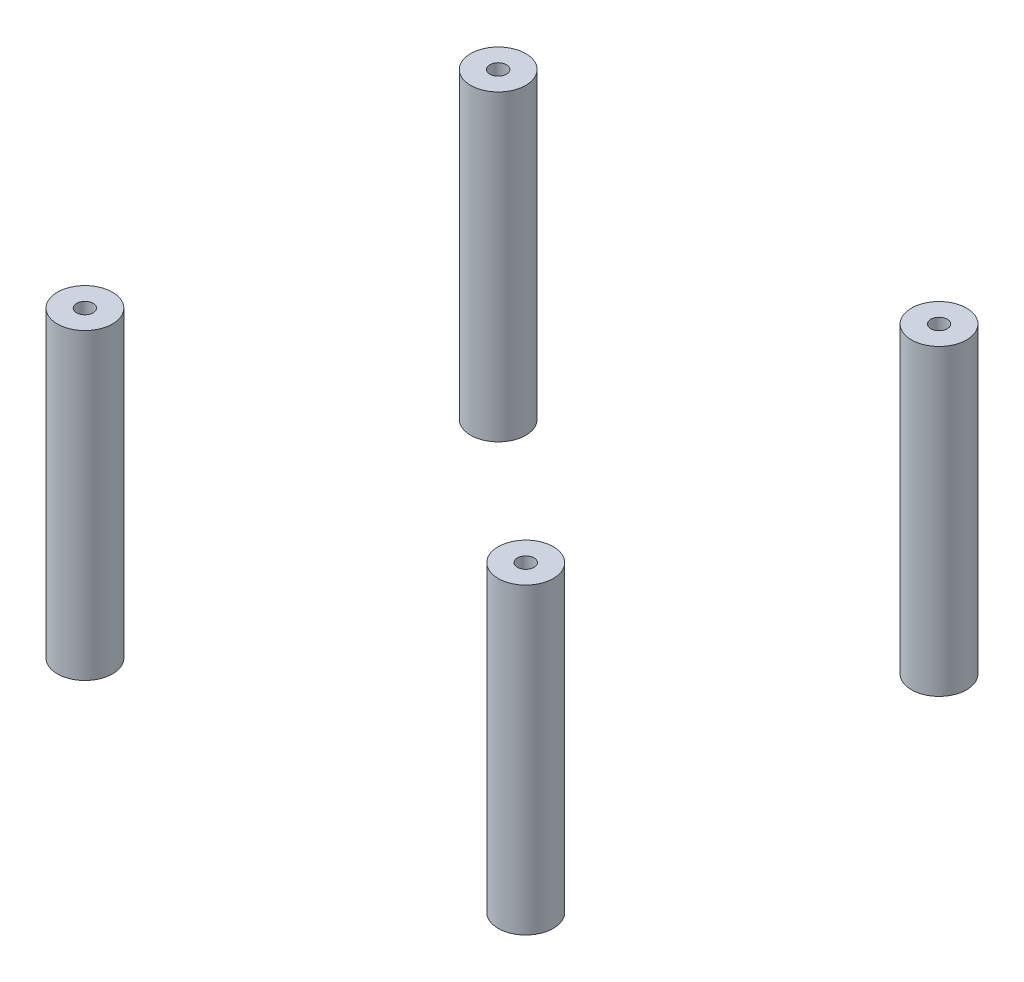
ISO-10303-21;
HEADER;
FILE_DESCRIPTION(('STEP AP214'),'2;1');
FILE_NAME('part.step','',(''),(''),'','','');
FILE_SCHEMA(('AUTOMOTIVE_DESIGN { 1 0 10303 214 1 1 1 1 }'));
ENDSEC;
DATA;
#1=APPLICATION_CONTEXT('core data for automotive mechanical design processes');
#2=APPLICATION_PROTOCOL_DEFINITION('international standard','automotive_design',2000,#1);
#3=PRODUCT_CONTEXT('',#1,'mechanical');
#4=PRODUCT('Part','Part','',(#3));
#5=PRODUCT_RELATED_PRODUCT_CATEGORY('part','',(#4));
#6=PRODUCT_DEFINITION_FORMATION('','',#4);
#7=PRODUCT_DEFINITION_CONTEXT('part definition',#1,'design');
#8=PRODUCT_DEFINITION('design','',#6,#7);
#9=PRODUCT_DEFINITION_SHAPE('','',#8);
#10=(LENGTH_UNIT() NAMED_UNIT(*) SI_UNIT(.MILLI.,.METRE.));
#11=(NAMED_UNIT(*) PLANE_ANGLE_UNIT() SI_UNIT($,.RADIAN.));
#12=(NAMED_UNIT(*) SI_UNIT($,.STERADIAN.) SOLID_ANGLE_UNIT());
#13=UNCERTAINTY_MEASURE_WITH_UNIT(LENGTH_MEASURE(1.E-05),#10,'distance_accuracy_value','');
#14=(GEOMETRIC_REPRESENTATION_CONTEXT(3) GLOBAL_UNCERTAINTY_ASSIGNED_CONTEXT((#13)) GLOBAL_UNIT_ASSIGNED_CONTEXT((#10,
#11,#12)) REPRESENTATION_CONTEXT('',''));
#15=CARTESIAN_POINT('',(0.,0.,0.));
#16=DIRECTION('',(0.,0.,1.));
#17=DIRECTION('',(1.,0.,0.));
#18=AXIS2_PLACEMENT_3D('',#15,#16,#17);
#19=CARTESIAN_POINT('',(-39.9999999999999,55.,37.5000000000001));
#20=DIRECTION('',(0.,1.,0.));
#21=DIRECTION('',(0.,0.,1.));
#22=AXIS2_PLACEMENT_3D('',#19,#20,#21);
#23=PLANE('',#22);
#24=CARTESIAN_POINT('',(-39.9999999999999,55.,37.5000000000001));
#25=DIRECTION('',(0.,1.,0.));
#26=DIRECTION('',(0.,0.,1.));
#27=AXIS2_PLACEMENT_3D('',#24,#25,#26);
#28=CIRCLE('',#27,4.99999999999998);
#29=CARTESIAN_POINT('',(-39.9999999999999,55.,42.5000000000001));
#30=VERTEX_POINT('',#29);
#31=EDGE_CURVE('E11',#30,#30,#28,.T.);
#32=ORIENTED_EDGE('',*,*,#31,.T.);
#33=EDGE_LOOP('',(#32));
#34=FACE_BOUND('',#33,.T.);
#35=CARTESIAN_POINT('',(-39.9999999999999,55.,37.5000000000001));
#36=DIRECTION('',(0.,1.,0.));
#37=DIRECTION('',(0.,0.,1.));
#38=AXIS2_PLACEMENT_3D('',#35,#36,#37);
#39=CIRCLE('',#38,1.5);
#40=CARTESIAN_POINT('',(-39.9999999999999,55.,39.0000000000001));
#41=VERTEX_POINT('',#40);
#42=EDGE_CURVE('E51',#41,#41,#39,.T.);
#43=ORIENTED_EDGE('',*,*,#42,.F.);
#44=EDGE_LOOP('',(#43));
#45=FACE_BOUND('',#44,.T.);
#46=ADVANCED_FACE('F40',(#34,#45),#23,.T.);
#47=CARTESIAN_POINT('',(-39.9999999999999,0.,37.5000000000001));
#48=DIRECTION('',(0.,1.,0.));
#49=DIRECTION('',(0.,0.,1.));
#50=AXIS2_PLACEMENT_3D('',#47,#48,#49);
#51=PLANE('',#50);
#52=CARTESIAN_POINT('',(-39.9999999999999,0.,37.5000000000001));
#53=DIRECTION('',(0.,1.,0.));
#54=DIRECTION('',(0.,0.,1.));
#55=AXIS2_PLACEMENT_3D('',#52,#53,#54);
#56=CIRCLE('',#55,4.99999999999998);
#57=CARTESIAN_POINT('',(-39.9999999999999,0.,42.5000000000001));
#58=VERTEX_POINT('',#57);
#59=EDGE_CURVE('E44',#58,#58,#56,.T.);
#60=ORIENTED_EDGE('',*,*,#59,.F.);
#61=EDGE_LOOP('',(#60));
#62=FACE_BOUND('',#61,.T.);
#63=CARTESIAN_POINT('',(-39.9999999999999,0.,37.5000000000001));
#64=DIRECTION('',(0.,1.,0.));
#65=DIRECTION('',(0.,0.,1.));
#66=AXIS2_PLACEMENT_3D('',#63,#64,#65);
#67=CIRCLE('',#66,1.5);
#68=CARTESIAN_POINT('',(-39.9999999999999,0.,39.0000000000001));
#69=VERTEX_POINT('',#68);
#70=EDGE_CURVE('E53',#69,#69,#67,.T.);
#71=ORIENTED_EDGE('',*,*,#70,.T.);
#72=EDGE_LOOP('',(#71));
#73=FACE_BOUND('',#72,.T.);
#74=ADVANCED_FACE('F63',(#62,#73),#51,.F.);
#75=CARTESIAN_POINT('',(-39.9999999999999,55.,37.5000000000001));
#76=DIRECTION('',(0.,-1.,0.));
#77=DIRECTION('',(0.,0.,-1.));
#78=AXIS2_PLACEMENT_3D('',#75,#76,#77);
#79=CYLINDRICAL_SURFACE('',#78,4.99999999999998);
#80=ORIENTED_EDGE('',*,*,#31,.F.);
#81=EDGE_LOOP('',(#80));
#82=FACE_BOUND('',#81,.T.);
#83=ORIENTED_EDGE('',*,*,#59,.T.);
#84=EDGE_LOOP('',(#83));
#85=FACE_BOUND('',#84,.T.);
#86=ADVANCED_FACE('F42',(#82,#85),#79,.T.);
#87=CARTESIAN_POINT('',(-39.9999999999999,55.,37.5000000000001));
#88=DIRECTION('',(0.,-1.,0.));
#89=DIRECTION('',(0.,0.,-1.));
#90=AXIS2_PLACEMENT_3D('',#87,#88,#89);
#91=CYLINDRICAL_SURFACE('',#90,1.5);
#92=ORIENTED_EDGE('',*,*,#42,.T.);
#93=EDGE_LOOP('',(#92));
#94=FACE_BOUND('',#93,.T.);
#95=ORIENTED_EDGE('',*,*,#70,.F.);
#96=EDGE_LOOP('',(#95));
#97=FACE_BOUND('',#96,.T.);
#98=ADVANCED_FACE('F59',(#94,#97),#91,.F.);
#99=CLOSED_SHELL('',(#46,#74,#86,#98));
#100=MANIFOLD_SOLID_BREP('B2',#99);
#101=CARTESIAN_POINT('',(40.0000000000002,55.,37.5000000000001));
#102=DIRECTION('',(0.,1.,0.));
#103=DIRECTION('',(0.,0.,1.));
#104=AXIS2_PLACEMENT_3D('',#101,#102,#103);
#105=PLANE('',#104);
#106=CARTESIAN_POINT('',(40.0000000000002,55.,37.5000000000001));
#107=DIRECTION('',(0.,1.,0.));
#108=DIRECTION('',(0.,0.,1.));
#109=AXIS2_PLACEMENT_3D('',#106,#107,#108);
#110=CIRCLE('',#109,4.99999999999998);
#111=CARTESIAN_POINT('',(40.0000000000002,55.,42.5000000000001));
#112=VERTEX_POINT('',#111);
#113=EDGE_CURVE('E39',#112,#112,#110,.T.);
#114=ORIENTED_EDGE('',*,*,#113,.T.);
#115=EDGE_LOOP('',(#114));
#116=FACE_BOUND('',#115,.T.);
#117=CARTESIAN_POINT('',(40.0000000000002,55.,37.5000000000001));
#118=DIRECTION('',(0.,1.,0.));
#119=DIRECTION('',(0.,0.,1.));
#120=AXIS2_PLACEMENT_3D('',#117,#118,#119);
#121=CIRCLE('',#120,1.5);
#122=CARTESIAN_POINT('',(40.0000000000002,55.,39.0000000000001));
#123=VERTEX_POINT('',#122);
#124=EDGE_CURVE('E121',#123,#123,#121,.T.);
#125=ORIENTED_EDGE('',*,*,#124,.F.);
#126=EDGE_LOOP('',(#125));
#127=FACE_BOUND('',#126,.T.);
#128=ADVANCED_FACE('F110',(#116,#127),#105,.T.);
#129=CARTESIAN_POINT('',(40.0000000000002,0.,37.5000000000001));
#130=DIRECTION('',(0.,1.,0.));
#131=DIRECTION('',(0.,0.,1.));
#132=AXIS2_PLACEMENT_3D('',#129,#130,#131);
#133=PLANE('',#132);
#134=CARTESIAN_POINT('',(40.0000000000002,0.,37.5000000000001));
#135=DIRECTION('',(0.,1.,0.));
#136=DIRECTION('',(0.,0.,1.));
#137=AXIS2_PLACEMENT_3D('',#134,#135,#136);
#138=CIRCLE('',#137,4.99999999999998);
#139=CARTESIAN_POINT('',(40.0000000000002,0.,42.5000000000001));
#140=VERTEX_POINT('',#139);
#141=EDGE_CURVE('E114',#140,#140,#138,.T.);
#142=ORIENTED_EDGE('',*,*,#141,.F.);
#143=EDGE_LOOP('',(#142));
#144=FACE_BOUND('',#143,.T.);
#145=CARTESIAN_POINT('',(40.0000000000002,0.,37.5000000000001));
#146=DIRECTION('',(0.,1.,0.));
#147=DIRECTION('',(0.,0.,1.));
#148=AXIS2_PLACEMENT_3D('',#145,#146,#147);
#149=CIRCLE('',#148,1.5);
#150=CARTESIAN_POINT('',(40.0000000000002,0.,39.0000000000001));
#151=VERTEX_POINT('',#150);
#152=EDGE_CURVE('E123',#151,#151,#149,.T.);
#153=ORIENTED_EDGE('',*,*,#152,.T.);
#154=EDGE_LOOP('',(#153));
#155=FACE_BOUND('',#154,.T.);
#156=ADVANCED_FACE('F133',(#144,#155),#133,.F.);
#157=CARTESIAN_POINT('',(40.0000000000002,55.,37.5000000000001));
#158=DIRECTION('',(0.,-1.,0.));
#159=DIRECTION('',(0.,0.,-1.));
#160=AXIS2_PLACEMENT_3D('',#157,#158,#159);
#161=CYLINDRICAL_SURFACE('',#160,4.99999999999998);
#162=ORIENTED_EDGE('',*,*,#113,.F.);
#163=EDGE_LOOP('',(#162));
#164=FACE_BOUND('',#163,.T.);
#165=ORIENTED_EDGE('',*,*,#141,.T.);
#166=EDGE_LOOP('',(#165));
#167=FACE_BOUND('',#166,.T.);
#168=ADVANCED_FACE('F112',(#164,#167),#161,.T.);
#169=CARTESIAN_POINT('',(40.0000000000002,55.,37.5000000000001));
#170=DIRECTION('',(0.,-1.,0.));
#171=DIRECTION('',(0.,0.,-1.));
#172=AXIS2_PLACEMENT_3D('',#169,#170,#171);
#173=CYLINDRICAL_SURFACE('',#172,1.5);
#174=ORIENTED_EDGE('',*,*,#124,.T.);
#175=EDGE_LOOP('',(#174));
#176=FACE_BOUND('',#175,.T.);
#177=ORIENTED_EDGE('',*,*,#152,.F.);
#178=EDGE_LOOP('',(#177));
#179=FACE_BOUND('',#178,.T.);
#180=ADVANCED_FACE('F129',(#176,#179),#173,.F.);
#181=CLOSED_SHELL('',(#128,#156,#168,#180));
#182=MANIFOLD_SOLID_BREP('B6',#181);
#183=CARTESIAN_POINT('',(40.0000000000001,55.,-37.5));
#184=DIRECTION('',(0.,1.,0.));
#185=DIRECTION('',(0.,0.,1.));
#186=AXIS2_PLACEMENT_3D('',#183,#184,#185);
#187=PLANE('',#186);
#188=CARTESIAN_POINT('',(40.0000000000001,55.,-37.5));
#189=DIRECTION('',(0.,1.,0.));
#190=DIRECTION('',(0.,0.,1.));
#191=AXIS2_PLACEMENT_3D('',#188,#189,#190);
#192=CIRCLE('',#191,5.);
#193=CARTESIAN_POINT('',(40.0000000000001,55.,-32.5));
#194=VERTEX_POINT('',#193);
#195=EDGE_CURVE('E109',#194,#194,#192,.T.);
#196=ORIENTED_EDGE('',*,*,#195,.T.);
#197=EDGE_LOOP('',(#196));
#198=FACE_BOUND('',#197,.T.);
#199=CARTESIAN_POINT('',(40.0000000000001,55.,-37.5));
#200=DIRECTION('',(0.,1.,0.));
#201=DIRECTION('',(0.,0.,1.));
#202=AXIS2_PLACEMENT_3D('',#199,#200,#201);
#203=CIRCLE('',#202,1.5);
#204=CARTESIAN_POINT('',(40.0000000000001,55.,-36.));
#205=VERTEX_POINT('',#204);
#206=EDGE_CURVE('E190',#205,#205,#203,.T.);
#207=ORIENTED_EDGE('',*,*,#206,.F.);
#208=EDGE_LOOP('',(#207));
#209=FACE_BOUND('',#208,.T.);
#210=ADVANCED_FACE('F179',(#198,#209),#187,.T.);
#211=CARTESIAN_POINT('',(40.0000000000001,0.,-37.5));
#212=DIRECTION('',(0.,1.,0.));
#213=DIRECTION('',(0.,0.,1.));
#214=AXIS2_PLACEMENT_3D('',#211,#212,#213);
#215=PLANE('',#214);
#216=CARTESIAN_POINT('',(40.0000000000001,0.,-37.5));
#217=DIRECTION('',(0.,1.,0.));
#218=DIRECTION('',(0.,0.,1.));
#219=AXIS2_PLACEMENT_3D('',#216,#217,#218);
#220=CIRCLE('',#219,5.);
#221=CARTESIAN_POINT('',(40.0000000000001,0.,-32.5));
#222=VERTEX_POINT('',#221);
#223=EDGE_CURVE('E183',#222,#222,#220,.T.);
#224=ORIENTED_EDGE('',*,*,#223,.F.);
#225=EDGE_LOOP('',(#224));
#226=FACE_BOUND('',#225,.T.);
#227=CARTESIAN_POINT('',(40.0000000000001,0.,-37.5));
#228=DIRECTION('',(0.,1.,0.));
#229=DIRECTION('',(0.,0.,1.));
#230=AXIS2_PLACEMENT_3D('',#227,#228,#229);
#231=CIRCLE('',#230,1.5);
#232=CARTESIAN_POINT('',(40.0000000000001,0.,-36.));
#233=VERTEX_POINT('',#232);
#234=EDGE_CURVE('E192',#233,#233,#231,.T.);
#235=ORIENTED_EDGE('',*,*,#234,.T.);
#236=EDGE_LOOP('',(#235));
#237=FACE_BOUND('',#236,.T.);
#238=ADVANCED_FACE('F202',(#226,#237),#215,.F.);
#239=CARTESIAN_POINT('',(40.0000000000001,55.,-37.5));
#240=DIRECTION('',(0.,-1.,0.));
#241=DIRECTION('',(0.,0.,-1.));
#242=AXIS2_PLACEMENT_3D('',#239,#240,#241);
#243=CYLINDRICAL_SURFACE('',#242,5.);
#244=ORIENTED_EDGE('',*,*,#195,.F.);
#245=EDGE_LOOP('',(#244));
#246=FACE_BOUND('',#245,.T.);
#247=ORIENTED_EDGE('',*,*,#223,.T.);
#248=EDGE_LOOP('',(#247));
#249=FACE_BOUND('',#248,.T.);
#250=ADVANCED_FACE('F181',(#246,#249),#243,.T.);
#251=CARTESIAN_POINT('',(40.0000000000001,55.,-37.5));
#252=DIRECTION('',(0.,-1.,0.));
#253=DIRECTION('',(0.,0.,-1.));
#254=AXIS2_PLACEMENT_3D('',#251,#252,#253);
#255=CYLINDRICAL_SURFACE('',#254,1.5);
#256=ORIENTED_EDGE('',*,*,#206,.T.);
#257=EDGE_LOOP('',(#256));
#258=FACE_BOUND('',#257,.T.);
#259=ORIENTED_EDGE('',*,*,#234,.F.);
#260=EDGE_LOOP('',(#259));
#261=FACE_BOUND('',#260,.T.);
#262=ADVANCED_FACE('F198',(#258,#261),#255,.F.);
#263=CLOSED_SHELL('',(#210,#238,#250,#262));
#264=MANIFOLD_SOLID_BREP('B34',#263);
#265=CARTESIAN_POINT('',(-39.9999999999999,55.,-37.5));
#266=DIRECTION('',(0.,1.,0.));
#267=DIRECTION('',(0.,0.,1.));
#268=AXIS2_PLACEMENT_3D('',#265,#266,#267);
#269=PLANE('',#268);
#270=CARTESIAN_POINT('',(-39.9999999999999,55.,-37.5));
#271=DIRECTION('',(0.,1.,0.));
#272=DIRECTION('',(0.,0.,1.));
#273=AXIS2_PLACEMENT_3D('',#270,#271,#272);
#274=CIRCLE('',#273,5.);
#275=CARTESIAN_POINT('',(-39.9999999999999,55.,-32.5));
#276=VERTEX_POINT('',#275);
#277=EDGE_CURVE('E178',#276,#276,#274,.T.);
#278=ORIENTED_EDGE('',*,*,#277,.T.);
#279=EDGE_LOOP('',(#278));
#280=FACE_BOUND('',#279,.T.);
#281=CARTESIAN_POINT('',(-39.9999999999999,55.,-37.5));
#282=DIRECTION('',(0.,1.,0.));
#283=DIRECTION('',(0.,0.,1.));
#284=AXIS2_PLACEMENT_3D('',#281,#282,#283);
#285=CIRCLE('',#284,1.5);
#286=CARTESIAN_POINT('',(-39.9999999999999,55.,-36.));
#287=VERTEX_POINT('',#286);
#288=EDGE_CURVE('E252',#287,#287,#285,.T.);
#289=ORIENTED_EDGE('',*,*,#288,.F.);
#290=EDGE_LOOP('',(#289));
#291=FACE_BOUND('',#290,.T.);
#292=ADVANCED_FACE('F241',(#280,#291),#269,.T.);
#293=CARTESIAN_POINT('',(-39.9999999999999,0.,-37.5));
#294=DIRECTION('',(0.,1.,0.));
#295=DIRECTION('',(0.,0.,1.));
#296=AXIS2_PLACEMENT_3D('',#293,#294,#295);
#297=PLANE('',#296);
#298=CARTESIAN_POINT('',(-39.9999999999999,0.,-37.5));
#299=DIRECTION('',(0.,1.,0.));
#300=DIRECTION('',(0.,0.,1.));
#301=AXIS2_PLACEMENT_3D('',#298,#299,#300);
#302=CIRCLE('',#301,5.);
#303=CARTESIAN_POINT('',(-39.9999999999999,0.,-32.5));
#304=VERTEX_POINT('',#303);
#305=EDGE_CURVE('E245',#304,#304,#302,.T.);
#306=ORIENTED_EDGE('',*,*,#305,.F.);
#307=EDGE_LOOP('',(#306));
#308=FACE_BOUND('',#307,.T.);
#309=CARTESIAN_POINT('',(-39.9999999999999,0.,-37.5));
#310=DIRECTION('',(0.,1.,0.));
#311=DIRECTION('',(0.,0.,1.));
#312=AXIS2_PLACEMENT_3D('',#309,#310,#311);
#313=CIRCLE('',#312,1.5);
#314=CARTESIAN_POINT('',(-39.9999999999999,0.,-36.));
#315=VERTEX_POINT('',#314);
#316=EDGE_CURVE('E254',#315,#315,#313,.T.);
#317=ORIENTED_EDGE('',*,*,#316,.T.);
#318=EDGE_LOOP('',(#317));
#319=FACE_BOUND('',#318,.T.);
#320=ADVANCED_FACE('F264',(#308,#319),#297,.F.);
#321=CARTESIAN_POINT('',(-39.9999999999999,55.,-37.5));
#322=DIRECTION('',(0.,-1.,0.));
#323=DIRECTION('',(0.,0.,-1.));
#324=AXIS2_PLACEMENT_3D('',#321,#322,#323);
#325=CYLINDRICAL_SURFACE('',#324,5.);
#326=ORIENTED_EDGE('',*,*,#277,.F.);
#327=EDGE_LOOP('',(#326));
#328=FACE_BOUND('',#327,.T.);
#329=ORIENTED_EDGE('',*,*,#305,.T.);
#330=EDGE_LOOP('',(#329));
#331=FACE_BOUND('',#330,.T.);
#332=ADVANCED_FACE('F243',(#328,#331),#325,.T.);
#333=CARTESIAN_POINT('',(-39.9999999999999,55.,-37.5));
#334=DIRECTION('',(0.,-1.,0.));
#335=DIRECTION('',(0.,0.,-1.));
#336=AXIS2_PLACEMENT_3D('',#333,#334,#335);
#337=CYLINDRICAL_SURFACE('',#336,1.5);
#338=ORIENTED_EDGE('',*,*,#288,.T.);
#339=EDGE_LOOP('',(#338));
#340=FACE_BOUND('',#339,.T.);
#341=ORIENTED_EDGE('',*,*,#316,.F.);
#342=EDGE_LOOP('',(#341));
#343=FACE_BOUND('',#342,.T.);
#344=ADVANCED_FACE('F260',(#340,#343),#337,.F.);
#345=CLOSED_SHELL('',(#292,#320,#332,#344));
#346=MANIFOLD_SOLID_BREP('B104',#345);
#347=ADVANCED_BREP_SHAPE_REPRESENTATION('',(#18,#100,#182,#264,#346),#14);
#348=SHAPE_DEFINITION_REPRESENTATION(#9,#347);
ENDSEC;
END-ISO-10303-21;
